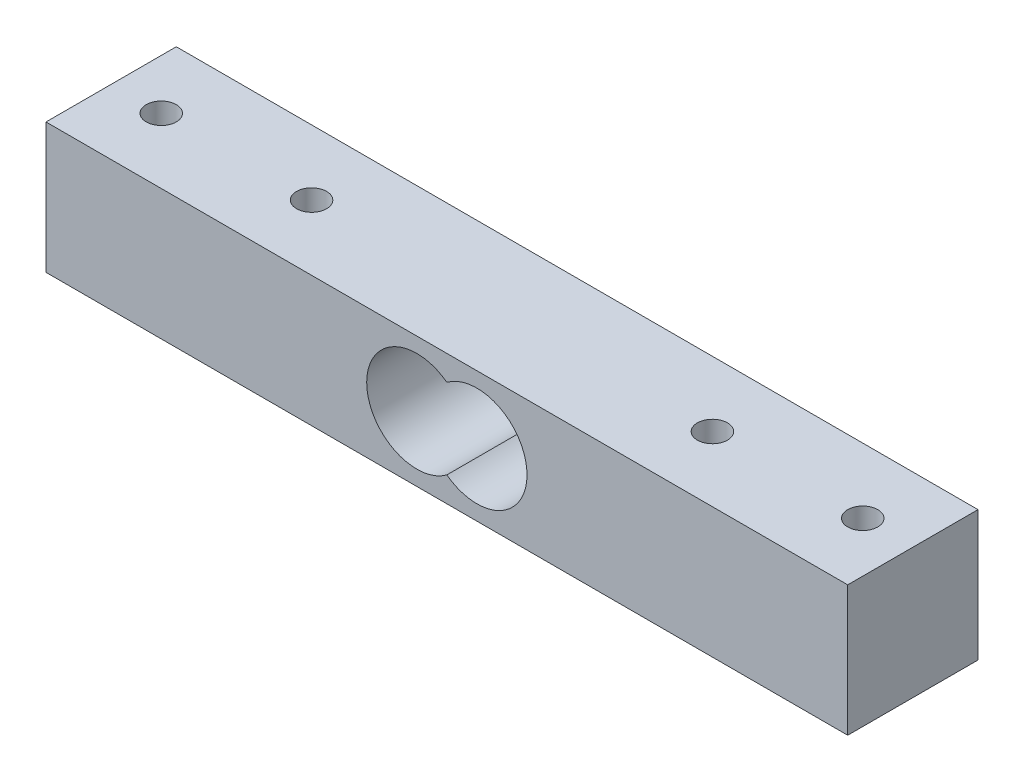
ISO-10303-21;
HEADER;
FILE_DESCRIPTION(('STEP AP214'),'2;1');
FILE_NAME('part.step','',(''),(''),'','','');
FILE_SCHEMA(('AUTOMOTIVE_DESIGN { 1 0 10303 214 1 1 1 1 }'));
ENDSEC;
DATA;
#1=APPLICATION_CONTEXT('core data for automotive mechanical design processes');
#2=APPLICATION_PROTOCOL_DEFINITION('international standard','automotive_design',2000,#1);
#3=PRODUCT_CONTEXT('',#1,'mechanical');
#4=PRODUCT('Part','Part','',(#3));
#5=PRODUCT_RELATED_PRODUCT_CATEGORY('part','',(#4));
#6=PRODUCT_DEFINITION_FORMATION('','',#4);
#7=PRODUCT_DEFINITION_CONTEXT('part definition',#1,'design');
#8=PRODUCT_DEFINITION('design','',#6,#7);
#9=PRODUCT_DEFINITION_SHAPE('','',#8);
#10=(LENGTH_UNIT() NAMED_UNIT(*) SI_UNIT(.MILLI.,.METRE.));
#11=(NAMED_UNIT(*) PLANE_ANGLE_UNIT() SI_UNIT($,.RADIAN.));
#12=(NAMED_UNIT(*) SI_UNIT($,.STERADIAN.) SOLID_ANGLE_UNIT());
#13=UNCERTAINTY_MEASURE_WITH_UNIT(LENGTH_MEASURE(1.E-05),#10,'distance_accuracy_value','');
#14=(GEOMETRIC_REPRESENTATION_CONTEXT(3) GLOBAL_UNCERTAINTY_ASSIGNED_CONTEXT((#13)) GLOBAL_UNIT_ASSIGNED_CONTEXT((#10,
#11,#12)) REPRESENTATION_CONTEXT('',''));
#15=CARTESIAN_POINT('',(0.,0.,0.));
#16=DIRECTION('',(0.,0.,1.));
#17=DIRECTION('',(1.,0.,0.));
#18=AXIS2_PLACEMENT_3D('',#15,#16,#17);
#19=CARTESIAN_POINT('',(40.,13.,6.5));
#20=DIRECTION('',(-1.,0.,0.));
#21=DIRECTION('',(0.,0.,1.));
#22=AXIS2_PLACEMENT_3D('',#19,#20,#21);
#23=PLANE('',#22);
#24=DIRECTION('',(0.,0.,-1.));
#25=VECTOR('',#24,1.);
#26=CARTESIAN_POINT('',(40.,0.,6.5));
#27=LINE('',#26,#25);
#28=CARTESIAN_POINT('',(40.,0.,6.5));
#29=VERTEX_POINT('',#28);
#30=CARTESIAN_POINT('',(40.,0.,-6.5));
#31=VERTEX_POINT('',#30);
#32=EDGE_CURVE('E86',#29,#31,#27,.T.);
#33=ORIENTED_EDGE('',*,*,#32,.T.);
#34=DIRECTION('',(0.,-1.,0.));
#35=VECTOR('',#34,1.);
#36=CARTESIAN_POINT('',(40.,13.,-6.5));
#37=LINE('',#36,#35);
#38=CARTESIAN_POINT('',(40.,13.,-6.5));
#39=VERTEX_POINT('',#38);
#40=EDGE_CURVE('E11',#39,#31,#37,.T.);
#41=ORIENTED_EDGE('',*,*,#40,.F.);
#42=DIRECTION('',(0.,0.,-1.));
#43=VECTOR('',#42,1.);
#44=CARTESIAN_POINT('',(40.,13.,6.5));
#45=LINE('',#44,#43);
#46=CARTESIAN_POINT('',(40.,13.,6.5));
#47=VERTEX_POINT('',#46);
#48=EDGE_CURVE('E107',#47,#39,#45,.T.);
#49=ORIENTED_EDGE('',*,*,#48,.F.);
#50=DIRECTION('',(0.,-1.,0.));
#51=VECTOR('',#50,1.);
#52=CARTESIAN_POINT('',(40.,13.,6.5));
#53=LINE('',#52,#51);
#54=EDGE_CURVE('E117',#47,#29,#53,.T.);
#55=ORIENTED_EDGE('',*,*,#54,.T.);
#56=EDGE_LOOP('',(#33,#41,#49,#55));
#57=FACE_BOUND('',#56,.T.);
#58=ADVANCED_FACE('F32',(#57),#23,.F.);
#59=CARTESIAN_POINT('',(-40.,13.,-6.5));
#60=DIRECTION('',(0.,0.,1.));
#61=DIRECTION('',(1.,0.,0.));
#62=AXIS2_PLACEMENT_3D('',#59,#60,#61);
#63=PLANE('',#62);
#64=CARTESIAN_POINT('',(3.,6.5,-6.5));
#65=DIRECTION('',(0.,0.,1.));
#66=DIRECTION('',(1.,0.,0.));
#67=AXIS2_PLACEMENT_3D('',#64,#65,#66);
#68=CIRCLE('',#67,5.);
#69=CARTESIAN_POINT('',(0.,2.5,-6.5));
#70=VERTEX_POINT('',#69);
#71=CARTESIAN_POINT('',(0.,10.5,-6.5));
#72=VERTEX_POINT('',#71);
#73=EDGE_CURVE('E104',#70,#72,#68,.T.);
#74=ORIENTED_EDGE('',*,*,#73,.T.);
#75=CARTESIAN_POINT('',(-2.99999999999998,6.50000000000001,-6.5));
#76=DIRECTION('',(0.,0.,1.));
#77=DIRECTION('',(-1.,0.,0.));
#78=AXIS2_PLACEMENT_3D('',#75,#76,#77);
#79=CIRCLE('',#78,5.);
#80=EDGE_CURVE('E46',#72,#70,#79,.T.);
#81=ORIENTED_EDGE('',*,*,#80,.T.);
#82=EDGE_LOOP('',(#74,#81));
#83=FACE_BOUND('',#82,.T.);
#84=DIRECTION('',(-1.,0.,0.));
#85=VECTOR('',#84,1.);
#86=CARTESIAN_POINT('',(-40.,0.,-6.5));
#87=LINE('',#86,#85);
#88=CARTESIAN_POINT('',(-40.,0.,-6.5));
#89=VERTEX_POINT('',#88);
#90=EDGE_CURVE('E120',#31,#89,#87,.T.);
#91=ORIENTED_EDGE('',*,*,#90,.T.);
#92=DIRECTION('',(0.,-1.,0.));
#93=VECTOR('',#92,1.);
#94=CARTESIAN_POINT('',(-40.,13.,-6.5));
#95=LINE('',#94,#93);
#96=CARTESIAN_POINT('',(-40.,13.,-6.5));
#97=VERTEX_POINT('',#96);
#98=EDGE_CURVE('E39',#97,#89,#95,.T.);
#99=ORIENTED_EDGE('',*,*,#98,.F.);
#100=DIRECTION('',(-1.,0.,0.));
#101=VECTOR('',#100,1.);
#102=CARTESIAN_POINT('',(-40.,13.,-6.5));
#103=LINE('',#102,#101);
#104=EDGE_CURVE('E110',#39,#97,#103,.T.);
#105=ORIENTED_EDGE('',*,*,#104,.F.);
#106=ORIENTED_EDGE('',*,*,#40,.T.);
#107=EDGE_LOOP('',(#91,#99,#105,#106));
#108=FACE_BOUND('',#107,.T.);
#109=ADVANCED_FACE('F148',(#83,#108),#63,.F.);
#110=CARTESIAN_POINT('',(-40.,13.,6.5));
#111=DIRECTION('',(1.,0.,0.));
#112=DIRECTION('',(0.,0.,-1.));
#113=AXIS2_PLACEMENT_3D('',#110,#111,#112);
#114=PLANE('',#113);
#115=DIRECTION('',(0.,0.,1.));
#116=VECTOR('',#115,1.);
#117=CARTESIAN_POINT('',(-40.,0.,6.5));
#118=LINE('',#117,#116);
#119=CARTESIAN_POINT('',(-40.,0.,6.5));
#120=VERTEX_POINT('',#119);
#121=EDGE_CURVE('E122',#89,#120,#118,.T.);
#122=ORIENTED_EDGE('',*,*,#121,.T.);
#123=DIRECTION('',(0.,-1.,0.));
#124=VECTOR('',#123,1.);
#125=CARTESIAN_POINT('',(-40.,13.,6.5));
#126=LINE('',#125,#124);
#127=CARTESIAN_POINT('',(-40.,13.,6.5));
#128=VERTEX_POINT('',#127);
#129=EDGE_CURVE('E127',#128,#120,#126,.T.);
#130=ORIENTED_EDGE('',*,*,#129,.F.);
#131=DIRECTION('',(0.,0.,1.));
#132=VECTOR('',#131,1.);
#133=CARTESIAN_POINT('',(-40.,13.,6.5));
#134=LINE('',#133,#132);
#135=EDGE_CURVE('E113',#97,#128,#134,.T.);
#136=ORIENTED_EDGE('',*,*,#135,.F.);
#137=ORIENTED_EDGE('',*,*,#98,.T.);
#138=EDGE_LOOP('',(#122,#130,#136,#137));
#139=FACE_BOUND('',#138,.T.);
#140=ADVANCED_FACE('F134',(#139),#114,.F.);
#141=CARTESIAN_POINT('',(-40.,13.,6.5));
#142=DIRECTION('',(0.,0.,-1.));
#143=DIRECTION('',(-1.,0.,0.));
#144=AXIS2_PLACEMENT_3D('',#141,#142,#143);
#145=PLANE('',#144);
#146=CARTESIAN_POINT('',(3.,6.5,6.5));
#147=DIRECTION('',(0.,0.,1.));
#148=DIRECTION('',(1.,0.,0.));
#149=AXIS2_PLACEMENT_3D('',#146,#147,#148);
#150=CIRCLE('',#149,5.);
#151=CARTESIAN_POINT('',(0.,2.5,6.5));
#152=VERTEX_POINT('',#151);
#153=CARTESIAN_POINT('',(0.,10.5,6.5));
#154=VERTEX_POINT('',#153);
#155=EDGE_CURVE('E90',#152,#154,#150,.T.);
#156=ORIENTED_EDGE('',*,*,#155,.F.);
#157=CARTESIAN_POINT('',(-2.99999999999998,6.50000000000001,6.5));
#158=DIRECTION('',(0.,0.,1.));
#159=DIRECTION('',(-1.,0.,0.));
#160=AXIS2_PLACEMENT_3D('',#157,#158,#159);
#161=CIRCLE('',#160,5.);
#162=EDGE_CURVE('E51',#154,#152,#161,.T.);
#163=ORIENTED_EDGE('',*,*,#162,.F.);
#164=EDGE_LOOP('',(#156,#163));
#165=FACE_BOUND('',#164,.T.);
#166=DIRECTION('',(1.,0.,0.));
#167=VECTOR('',#166,1.);
#168=CARTESIAN_POINT('',(-40.,0.,6.5));
#169=LINE('',#168,#167);
#170=EDGE_CURVE('E111',#120,#29,#169,.T.);
#171=ORIENTED_EDGE('',*,*,#170,.T.);
#172=ORIENTED_EDGE('',*,*,#54,.F.);
#173=DIRECTION('',(1.,0.,0.));
#174=VECTOR('',#173,1.);
#175=CARTESIAN_POINT('',(-40.,13.,6.5));
#176=LINE('',#175,#174);
#177=EDGE_CURVE('E115',#128,#47,#176,.T.);
#178=ORIENTED_EDGE('',*,*,#177,.F.);
#179=ORIENTED_EDGE('',*,*,#129,.T.);
#180=EDGE_LOOP('',(#171,#172,#178,#179));
#181=FACE_BOUND('',#180,.T.);
#182=ADVANCED_FACE('F94',(#165,#181),#145,.F.);
#183=CARTESIAN_POINT('',(0.,13.,0.));
#184=DIRECTION('',(0.,-1.,0.));
#185=DIRECTION('',(0.,0.,-1.));
#186=AXIS2_PLACEMENT_3D('',#183,#184,#185);
#187=PLANE('',#186);
#188=CARTESIAN_POINT('',(35.,13.,0.));
#189=DIRECTION('',(0.,1.,0.));
#190=DIRECTION('',(0.,0.,-1.));
#191=AXIS2_PLACEMENT_3D('',#188,#189,#190);
#192=CIRCLE('',#191,1.5);
#193=CARTESIAN_POINT('',(35.,13.,-1.5));
#194=VERTEX_POINT('',#193);
#195=EDGE_CURVE('E192',#194,#194,#192,.T.);
#196=ORIENTED_EDGE('',*,*,#195,.F.);
#197=EDGE_LOOP('',(#196));
#198=FACE_BOUND('',#197,.T.);
#199=CARTESIAN_POINT('',(20.,13.,0.));
#200=DIRECTION('',(0.,1.,0.));
#201=DIRECTION('',(0.,0.,-1.));
#202=AXIS2_PLACEMENT_3D('',#199,#200,#201);
#203=CIRCLE('',#202,1.5);
#204=CARTESIAN_POINT('',(20.,13.,-1.5));
#205=VERTEX_POINT('',#204);
#206=EDGE_CURVE('E196',#205,#205,#203,.T.);
#207=ORIENTED_EDGE('',*,*,#206,.F.);
#208=EDGE_LOOP('',(#207));
#209=FACE_BOUND('',#208,.T.);
#210=CARTESIAN_POINT('',(-20.,13.,0.));
#211=DIRECTION('',(0.,1.,0.));
#212=DIRECTION('',(0.,0.,1.));
#213=AXIS2_PLACEMENT_3D('',#210,#211,#212);
#214=CIRCLE('',#213,1.5);
#215=CARTESIAN_POINT('',(-20.,13.,1.5));
#216=VERTEX_POINT('',#215);
#217=EDGE_CURVE('E203',#216,#216,#214,.T.);
#218=ORIENTED_EDGE('',*,*,#217,.F.);
#219=EDGE_LOOP('',(#218));
#220=FACE_BOUND('',#219,.T.);
#221=CARTESIAN_POINT('',(-35.,13.,0.));
#222=DIRECTION('',(0.,1.,0.));
#223=DIRECTION('',(0.,0.,1.));
#224=AXIS2_PLACEMENT_3D('',#221,#222,#223);
#225=CIRCLE('',#224,1.5);
#226=CARTESIAN_POINT('',(-35.,13.,1.5));
#227=VERTEX_POINT('',#226);
#228=EDGE_CURVE('E96',#227,#227,#225,.T.);
#229=ORIENTED_EDGE('',*,*,#228,.F.);
#230=EDGE_LOOP('',(#229));
#231=FACE_BOUND('',#230,.T.);
#232=ORIENTED_EDGE('',*,*,#48,.T.);
#233=ORIENTED_EDGE('',*,*,#104,.T.);
#234=ORIENTED_EDGE('',*,*,#135,.T.);
#235=ORIENTED_EDGE('',*,*,#177,.T.);
#236=EDGE_LOOP('',(#232,#233,#234,#235));
#237=FACE_BOUND('',#236,.T.);
#238=ADVANCED_FACE('F147',(#198,#209,#220,#231,#237),#187,.F.);
#239=CARTESIAN_POINT('',(0.,0.,0.));
#240=DIRECTION('',(0.,-1.,0.));
#241=DIRECTION('',(0.,0.,-1.));
#242=AXIS2_PLACEMENT_3D('',#239,#240,#241);
#243=PLANE('',#242);
#244=CARTESIAN_POINT('',(35.,0.,0.));
#245=DIRECTION('',(0.,-1.,0.));
#246=DIRECTION('',(0.,0.,-1.));
#247=AXIS2_PLACEMENT_3D('',#244,#245,#246);
#248=CIRCLE('',#247,1.5);
#249=CARTESIAN_POINT('',(35.,0.,-1.5));
#250=VERTEX_POINT('',#249);
#251=EDGE_CURVE('E189',#250,#250,#248,.F.);
#252=ORIENTED_EDGE('',*,*,#251,.T.);
#253=EDGE_LOOP('',(#252));
#254=FACE_BOUND('',#253,.T.);
#255=CARTESIAN_POINT('',(20.,0.,0.));
#256=DIRECTION('',(0.,-1.,0.));
#257=DIRECTION('',(0.,0.,-1.));
#258=AXIS2_PLACEMENT_3D('',#255,#256,#257);
#259=CIRCLE('',#258,1.5);
#260=CARTESIAN_POINT('',(20.,0.,-1.5));
#261=VERTEX_POINT('',#260);
#262=EDGE_CURVE('E193',#261,#261,#259,.F.);
#263=ORIENTED_EDGE('',*,*,#262,.T.);
#264=EDGE_LOOP('',(#263));
#265=FACE_BOUND('',#264,.T.);
#266=CARTESIAN_POINT('',(-20.,0.,0.));
#267=DIRECTION('',(0.,-1.,0.));
#268=DIRECTION('',(0.,0.,-1.));
#269=AXIS2_PLACEMENT_3D('',#266,#267,#268);
#270=CIRCLE('',#269,1.5);
#271=CARTESIAN_POINT('',(-20.,0.,-1.5));
#272=VERTEX_POINT('',#271);
#273=EDGE_CURVE('E201',#272,#272,#270,.F.);
#274=ORIENTED_EDGE('',*,*,#273,.T.);
#275=EDGE_LOOP('',(#274));
#276=FACE_BOUND('',#275,.T.);
#277=CARTESIAN_POINT('',(-35.,0.,0.));
#278=DIRECTION('',(0.,-1.,0.));
#279=DIRECTION('',(0.,0.,-1.));
#280=AXIS2_PLACEMENT_3D('',#277,#278,#279);
#281=CIRCLE('',#280,1.5);
#282=CARTESIAN_POINT('',(-35.,0.,-1.5));
#283=VERTEX_POINT('',#282);
#284=EDGE_CURVE('E99',#283,#283,#281,.F.);
#285=ORIENTED_EDGE('',*,*,#284,.T.);
#286=EDGE_LOOP('',(#285));
#287=FACE_BOUND('',#286,.T.);
#288=ORIENTED_EDGE('',*,*,#32,.F.);
#289=ORIENTED_EDGE('',*,*,#170,.F.);
#290=ORIENTED_EDGE('',*,*,#121,.F.);
#291=ORIENTED_EDGE('',*,*,#90,.F.);
#292=EDGE_LOOP('',(#288,#289,#290,#291));
#293=FACE_BOUND('',#292,.T.);
#294=ADVANCED_FACE('F140',(#254,#265,#276,#287,#293),#243,.T.);
#295=CARTESIAN_POINT('',(-2.99999999999998,6.50000000000001,-6.5));
#296=DIRECTION('',(0.,0.,1.));
#297=DIRECTION('',(1.,0.,0.));
#298=AXIS2_PLACEMENT_3D('',#295,#296,#297);
#299=CYLINDRICAL_SURFACE('',#298,5.);
#300=DIRECTION('',(0.,0.,1.));
#301=VECTOR('',#300,1.);
#302=CARTESIAN_POINT('',(0.,2.5,-6.5));
#303=LINE('',#302,#301);
#304=EDGE_CURVE('E87',#70,#152,#303,.T.);
#305=ORIENTED_EDGE('',*,*,#304,.F.);
#306=ORIENTED_EDGE('',*,*,#80,.F.);
#307=DIRECTION('',(0.,0.,1.));
#308=VECTOR('',#307,1.);
#309=CARTESIAN_POINT('',(0.,10.5,-6.5));
#310=LINE('',#309,#308);
#311=EDGE_CURVE('E80',#72,#154,#310,.T.);
#312=ORIENTED_EDGE('',*,*,#311,.T.);
#313=ORIENTED_EDGE('',*,*,#162,.T.);
#314=EDGE_LOOP('',(#305,#306,#312,#313));
#315=FACE_BOUND('',#314,.T.);
#316=ADVANCED_FACE('F82',(#315),#299,.F.);
#317=CARTESIAN_POINT('',(3.,6.5,-6.5));
#318=DIRECTION('',(0.,0.,1.));
#319=DIRECTION('',(1.,0.,0.));
#320=AXIS2_PLACEMENT_3D('',#317,#318,#319);
#321=CYLINDRICAL_SURFACE('',#320,5.);
#322=ORIENTED_EDGE('',*,*,#311,.F.);
#323=ORIENTED_EDGE('',*,*,#73,.F.);
#324=ORIENTED_EDGE('',*,*,#304,.T.);
#325=ORIENTED_EDGE('',*,*,#155,.T.);
#326=EDGE_LOOP('',(#322,#323,#324,#325));
#327=FACE_BOUND('',#326,.T.);
#328=ADVANCED_FACE('F91',(#327),#321,.F.);
#329=CARTESIAN_POINT('',(-35.,-0.000999999999999265,0.));
#330=DIRECTION('',(0.,1.,0.));
#331=DIRECTION('',(0.,0.,1.));
#332=AXIS2_PLACEMENT_3D('',#329,#330,#331);
#333=CYLINDRICAL_SURFACE('',#332,1.5);
#334=ORIENTED_EDGE('',*,*,#284,.F.);
#335=EDGE_LOOP('',(#334));
#336=FACE_BOUND('',#335,.T.);
#337=ORIENTED_EDGE('',*,*,#228,.T.);
#338=EDGE_LOOP('',(#337));
#339=FACE_BOUND('',#338,.T.);
#340=ADVANCED_FACE('F169',(#336,#339),#333,.F.);
#341=CARTESIAN_POINT('',(-20.,-0.000999999999999265,0.));
#342=DIRECTION('',(0.,1.,0.));
#343=DIRECTION('',(0.,0.,1.));
#344=AXIS2_PLACEMENT_3D('',#341,#342,#343);
#345=CYLINDRICAL_SURFACE('',#344,1.5);
#346=ORIENTED_EDGE('',*,*,#273,.F.);
#347=EDGE_LOOP('',(#346));
#348=FACE_BOUND('',#347,.T.);
#349=ORIENTED_EDGE('',*,*,#217,.T.);
#350=EDGE_LOOP('',(#349));
#351=FACE_BOUND('',#350,.T.);
#352=ADVANCED_FACE('F172',(#348,#351),#345,.F.);
#353=CARTESIAN_POINT('',(20.,-0.000999999999999265,0.));
#354=DIRECTION('',(0.,1.,0.));
#355=DIRECTION('',(0.,0.,1.));
#356=AXIS2_PLACEMENT_3D('',#353,#354,#355);
#357=CYLINDRICAL_SURFACE('',#356,1.5);
#358=ORIENTED_EDGE('',*,*,#262,.F.);
#359=EDGE_LOOP('',(#358));
#360=FACE_BOUND('',#359,.T.);
#361=ORIENTED_EDGE('',*,*,#206,.T.);
#362=EDGE_LOOP('',(#361));
#363=FACE_BOUND('',#362,.T.);
#364=ADVANCED_FACE('F176',(#360,#363),#357,.F.);
#365=CARTESIAN_POINT('',(35.,-0.000999999999999265,0.));
#366=DIRECTION('',(0.,1.,0.));
#367=DIRECTION('',(0.,0.,1.));
#368=AXIS2_PLACEMENT_3D('',#365,#366,#367);
#369=CYLINDRICAL_SURFACE('',#368,1.5);
#370=ORIENTED_EDGE('',*,*,#251,.F.);
#371=EDGE_LOOP('',(#370));
#372=FACE_BOUND('',#371,.T.);
#373=ORIENTED_EDGE('',*,*,#195,.T.);
#374=EDGE_LOOP('',(#373));
#375=FACE_BOUND('',#374,.T.);
#376=ADVANCED_FACE('F180',(#372,#375),#369,.F.);
#377=CLOSED_SHELL('',(#58,#109,#140,#182,#238,#294,#316,#328,#340,#352,#364,#376));
#378=MANIFOLD_SOLID_BREP('B2',#377);
#379=ADVANCED_BREP_SHAPE_REPRESENTATION('',(#18,#378),#14);
#380=SHAPE_DEFINITION_REPRESENTATION(#9,#379);
ENDSEC;
END-ISO-10303-21;
